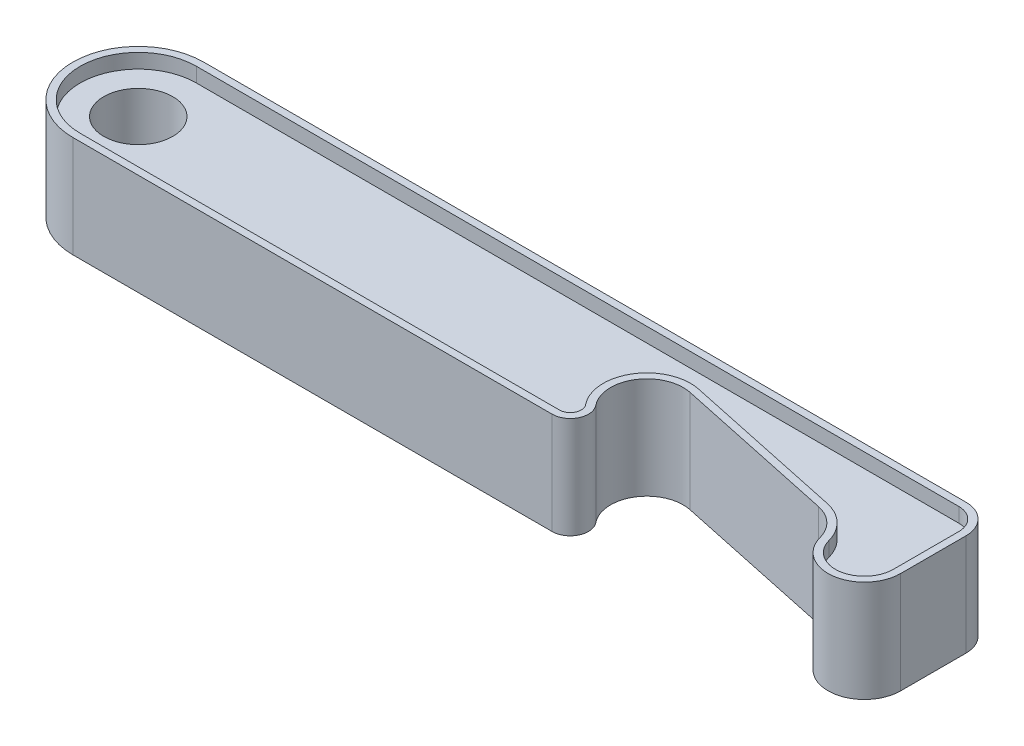
ISO-10303-21;
HEADER;
FILE_DESCRIPTION(('STEP AP214'),'2;1');
FILE_NAME('part.step','',(''),(''),'','','');
FILE_SCHEMA(('AUTOMOTIVE_DESIGN { 1 0 10303 214 1 1 1 1 }'));
ENDSEC;
DATA;
#1=APPLICATION_CONTEXT('core data for automotive mechanical design processes');
#2=APPLICATION_PROTOCOL_DEFINITION('international standard','automotive_design',2000,#1);
#3=PRODUCT_CONTEXT('',#1,'mechanical');
#4=PRODUCT('Part','Part','',(#3));
#5=PRODUCT_RELATED_PRODUCT_CATEGORY('part','',(#4));
#6=PRODUCT_DEFINITION_FORMATION('','',#4);
#7=PRODUCT_DEFINITION_CONTEXT('part definition',#1,'design');
#8=PRODUCT_DEFINITION('design','',#6,#7);
#9=PRODUCT_DEFINITION_SHAPE('','',#8);
#10=(LENGTH_UNIT() NAMED_UNIT(*) SI_UNIT(.MILLI.,.METRE.));
#11=(NAMED_UNIT(*) PLANE_ANGLE_UNIT() SI_UNIT($,.RADIAN.));
#12=(NAMED_UNIT(*) SI_UNIT($,.STERADIAN.) SOLID_ANGLE_UNIT());
#13=UNCERTAINTY_MEASURE_WITH_UNIT(LENGTH_MEASURE(1.E-05),#10,'distance_accuracy_value','');
#14=(GEOMETRIC_REPRESENTATION_CONTEXT(3) GLOBAL_UNCERTAINTY_ASSIGNED_CONTEXT((#13)) GLOBAL_UNIT_ASSIGNED_CONTEXT((#10,
#11,#12)) REPRESENTATION_CONTEXT('',''));
#15=CARTESIAN_POINT('',(0.,0.,0.));
#16=DIRECTION('',(0.,0.,1.));
#17=DIRECTION('',(1.,0.,0.));
#18=AXIS2_PLACEMENT_3D('',#15,#16,#17);
#19=CARTESIAN_POINT('',(0.,14.,0.));
#20=DIRECTION('',(0.,-1.,0.));
#21=DIRECTION('',(0.,0.,-1.));
#22=AXIS2_PLACEMENT_3D('',#19,#20,#21);
#23=CYLINDRICAL_SURFACE('',#22,4.75);
#24=CARTESIAN_POINT('',(0.,12.,0.));
#25=DIRECTION('',(0.,1.,0.));
#26=DIRECTION('',(0.,0.,1.));
#27=AXIS2_PLACEMENT_3D('',#24,#25,#26);
#28=CIRCLE('',#27,4.75);
#29=CARTESIAN_POINT('',(0.,12.,4.75));
#30=VERTEX_POINT('',#29);
#31=EDGE_CURVE('E383',#30,#30,#28,.T.);
#32=ORIENTED_EDGE('',*,*,#31,.T.);
#33=EDGE_LOOP('',(#32));
#34=FACE_BOUND('',#33,.T.);
#35=CARTESIAN_POINT('',(0.,2.,0.));
#36=DIRECTION('',(0.,-1.,0.));
#37=DIRECTION('',(0.,0.,-1.));
#38=AXIS2_PLACEMENT_3D('',#35,#36,#37);
#39=CIRCLE('',#38,4.75);
#40=CARTESIAN_POINT('',(0.,2.,-4.75));
#41=VERTEX_POINT('',#40);
#42=EDGE_CURVE('E41',#41,#41,#39,.T.);
#43=ORIENTED_EDGE('',*,*,#42,.T.);
#44=EDGE_LOOP('',(#43));
#45=FACE_BOUND('',#44,.T.);
#46=ADVANCED_FACE('F37',(#34,#45),#23,.F.);
#47=CARTESIAN_POINT('',(0.,14.,0.));
#48=DIRECTION('',(0.,-1.,0.));
#49=DIRECTION('',(0.,0.,-1.));
#50=AXIS2_PLACEMENT_3D('',#47,#48,#49);
#51=PLANE('',#50);
#52=DIRECTION('',(1.,0.,0.));
#53=VECTOR('',#52,1.);
#54=CARTESIAN_POINT('',(0.,14.,8.));
#55=LINE('',#54,#53);
#56=CARTESIAN_POINT('',(0.,14.,8.));
#57=VERTEX_POINT('',#56);
#58=CARTESIAN_POINT('',(66.,14.,7.99999999999998));
#59=VERTEX_POINT('',#58);
#60=EDGE_CURVE('E355',#57,#59,#55,.T.);
#61=ORIENTED_EDGE('',*,*,#60,.F.);
#62=CARTESIAN_POINT('',(0.,14.,0.));
#63=DIRECTION('',(0.,1.,0.));
#64=DIRECTION('',(0.,0.,1.));
#65=AXIS2_PLACEMENT_3D('',#62,#63,#64);
#66=CIRCLE('',#65,8.);
#67=CARTESIAN_POINT('',(0.,14.,-8.));
#68=VERTEX_POINT('',#67);
#69=EDGE_CURVE('E62',#68,#57,#66,.T.);
#70=ORIENTED_EDGE('',*,*,#69,.F.);
#71=DIRECTION('',(-1.,0.,0.));
#72=VECTOR('',#71,1.);
#73=CARTESIAN_POINT('',(105.,14.,-8.));
#74=LINE('',#73,#72);
#75=CARTESIAN_POINT('',(105.,14.,-8.));
#76=VERTEX_POINT('',#75);
#77=EDGE_CURVE('E326',#76,#68,#74,.T.);
#78=ORIENTED_EDGE('',*,*,#77,.F.);
#79=CARTESIAN_POINT('',(105.,14.,-5.));
#80=DIRECTION('',(0.,1.,0.));
#81=DIRECTION('',(0.,0.,1.));
#82=AXIS2_PLACEMENT_3D('',#79,#80,#81);
#83=CIRCLE('',#82,3.);
#84=CARTESIAN_POINT('',(108.,14.,-5.));
#85=VERTEX_POINT('',#84);
#86=EDGE_CURVE('E376',#85,#76,#83,.T.);
#87=ORIENTED_EDGE('',*,*,#86,.F.);
#88=DIRECTION('',(0.,0.,-1.));
#89=VECTOR('',#88,1.);
#90=CARTESIAN_POINT('',(108.,14.,4.));
#91=LINE('',#90,#89);
#92=CARTESIAN_POINT('',(108.,14.,4.));
#93=VERTEX_POINT('',#92);
#94=EDGE_CURVE('E373',#93,#85,#91,.T.);
#95=ORIENTED_EDGE('',*,*,#94,.F.);
#96=CARTESIAN_POINT('',(104.,14.,4.));
#97=DIRECTION('',(0.,1.,0.));
#98=DIRECTION('',(0.,0.,1.));
#99=AXIS2_PLACEMENT_3D('',#96,#97,#98);
#100=CIRCLE('',#99,4.);
#101=CARTESIAN_POINT('',(100.134614428619,14.,5.02897734890542));
#102=VERTEX_POINT('',#101);
#103=EDGE_CURVE('E370',#102,#93,#100,.T.);
#104=ORIENTED_EDGE('',*,*,#103,.F.);
#105=CARTESIAN_POINT('',(94.3365360715478,14.,6.57244337226353));
#106=DIRECTION('',(0.,-1.,0.));
#107=DIRECTION('',(0.,0.,1.));
#108=AXIS2_PLACEMENT_3D('',#105,#106,#107);
#109=CIRCLE('',#108,6.00000000000001);
#110=CARTESIAN_POINT('',(95.5840062164543,14.,0.703557767860689));
#111=VERTEX_POINT('',#110);
#112=EDGE_CURVE('E367',#111,#102,#109,.T.);
#113=ORIENTED_EDGE('',*,*,#112,.F.);
#114=DIRECTION('',(0.978147600733806,0.,0.207911690817759));
#115=VECTOR('',#114,1.);
#116=CARTESIAN_POINT('',(73.0840062164543,14.,-4.07896486971481));
#117=LINE('',#116,#115);
#118=CARTESIAN_POINT('',(73.0840062164543,14.,-4.07896486971481));
#119=VERTEX_POINT('',#118);
#120=EDGE_CURVE('E364',#119,#111,#117,.T.);
#121=ORIENTED_EDGE('',*,*,#120,.F.);
#122=CARTESIAN_POINT('',(71.8365360715477,14.,1.78992073468803));
#123=DIRECTION('',(0.,-1.,0.));
#124=DIRECTION('',(0.,0.,1.));
#125=AXIS2_PLACEMENT_3D('',#122,#123,#124);
#126=CIRCLE('',#125,6.);
#127=CARTESIAN_POINT('',(67.1673072143095,14.,5.55798414693761));
#128=VERTEX_POINT('',#127);
#129=EDGE_CURVE('E361',#128,#119,#126,.T.);
#130=ORIENTED_EDGE('',*,*,#129,.F.);
#131=CARTESIAN_POINT('',(66.,14.,6.5));
#132=DIRECTION('',(0.,1.,0.));
#133=DIRECTION('',(0.,0.,1.));
#134=AXIS2_PLACEMENT_3D('',#131,#132,#133);
#135=CIRCLE('',#134,1.49999999999999);
#136=EDGE_CURVE('E358',#59,#128,#135,.T.);
#137=ORIENTED_EDGE('',*,*,#136,.F.);
#138=EDGE_LOOP('',(#61,#70,#78,#87,#95,#104,#113,#121,#130,#137));
#139=FACE_BOUND('',#138,.T.);
#140=CARTESIAN_POINT('',(0.,14.,0.));
#141=DIRECTION('',(0.,1.,0.));
#142=DIRECTION('',(0.,0.,-1.));
#143=AXIS2_PLACEMENT_3D('',#140,#141,#142);
#144=CIRCLE('',#143,9.);
#145=CARTESIAN_POINT('',(0.,14.,-9.));
#146=VERTEX_POINT('',#145);
#147=CARTESIAN_POINT('',(0.,14.,9.00000000000001));
#148=VERTEX_POINT('',#147);
#149=EDGE_CURVE('E401',#146,#148,#144,.T.);
#150=ORIENTED_EDGE('',*,*,#149,.T.);
#151=DIRECTION('',(1.,0.,0.));
#152=VECTOR('',#151,1.);
#153=CARTESIAN_POINT('',(66.,14.,8.99999999999999));
#154=LINE('',#153,#152);
#155=CARTESIAN_POINT('',(66.,14.,8.99999999999999));
#156=VERTEX_POINT('',#155);
#157=EDGE_CURVE('E404',#148,#156,#154,.T.);
#158=ORIENTED_EDGE('',*,*,#157,.T.);
#159=CARTESIAN_POINT('',(66.,14.,6.5));
#160=DIRECTION('',(0.,1.,0.));
#161=DIRECTION('',(0.,0.,-1.));
#162=AXIS2_PLACEMENT_3D('',#159,#160,#161);
#163=CIRCLE('',#162,2.49999999999999);
#164=CARTESIAN_POINT('',(67.9455120238492,14.,4.92997357822934));
#165=VERTEX_POINT('',#164);
#166=EDGE_CURVE('E407',#156,#165,#163,.T.);
#167=ORIENTED_EDGE('',*,*,#166,.T.);
#168=CARTESIAN_POINT('',(71.8365360715477,14.,1.78992073468803));
#169=DIRECTION('',(0.,-1.,0.));
#170=DIRECTION('',(0.,0.,1.));
#171=AXIS2_PLACEMENT_3D('',#168,#169,#170);
#172=CIRCLE('',#171,5.);
#173=CARTESIAN_POINT('',(72.8760945256365,14.,-3.100817268981));
#174=VERTEX_POINT('',#173);
#175=EDGE_CURVE('E409',#165,#174,#172,.T.);
#176=ORIENTED_EDGE('',*,*,#175,.T.);
#177=DIRECTION('',(0.978147600733805,0.,0.20791169081776));
#178=VECTOR('',#177,1.);
#179=CARTESIAN_POINT('',(95.3760945256366,14.,1.6817053685945));
#180=LINE('',#179,#178);
#181=CARTESIAN_POINT('',(95.3760945256366,14.,1.68170536859449));
#182=VERTEX_POINT('',#181);
#183=EDGE_CURVE('E411',#174,#182,#180,.T.);
#184=ORIENTED_EDGE('',*,*,#183,.T.);
#185=CARTESIAN_POINT('',(94.3365360715478,14.,6.57244337226353));
#186=DIRECTION('',(0.,-1.,0.));
#187=DIRECTION('',(0.,0.,1.));
#188=AXIS2_PLACEMENT_3D('',#185,#186,#187);
#189=CIRCLE('',#188,5.00000000000001);
#190=CARTESIAN_POINT('',(99.1682680357739,14.,5.28622168613177));
#191=VERTEX_POINT('',#190);
#192=EDGE_CURVE('E413',#182,#191,#189,.T.);
#193=ORIENTED_EDGE('',*,*,#192,.T.);
#194=CARTESIAN_POINT('',(104.,14.,4.));
#195=DIRECTION('',(0.,1.,0.));
#196=DIRECTION('',(0.,0.,-1.));
#197=AXIS2_PLACEMENT_3D('',#194,#195,#196);
#198=CIRCLE('',#197,5.);
#199=CARTESIAN_POINT('',(109.,14.,4.));
#200=VERTEX_POINT('',#199);
#201=EDGE_CURVE('E415',#191,#200,#198,.T.);
#202=ORIENTED_EDGE('',*,*,#201,.T.);
#203=DIRECTION('',(0.,0.,-1.));
#204=VECTOR('',#203,1.);
#205=CARTESIAN_POINT('',(109.,14.,-5.));
#206=LINE('',#205,#204);
#207=CARTESIAN_POINT('',(109.,14.,-5.));
#208=VERTEX_POINT('',#207);
#209=EDGE_CURVE('E417',#200,#208,#206,.T.);
#210=ORIENTED_EDGE('',*,*,#209,.T.);
#211=CARTESIAN_POINT('',(105.,14.,-5.));
#212=DIRECTION('',(0.,1.,0.));
#213=DIRECTION('',(0.,0.,-1.));
#214=AXIS2_PLACEMENT_3D('',#211,#212,#213);
#215=CIRCLE('',#214,4.);
#216=CARTESIAN_POINT('',(105.,14.,-9.));
#217=VERTEX_POINT('',#216);
#218=EDGE_CURVE('E419',#208,#217,#215,.T.);
#219=ORIENTED_EDGE('',*,*,#218,.T.);
#220=DIRECTION('',(-1.,0.,0.));
#221=VECTOR('',#220,1.);
#222=CARTESIAN_POINT('',(0.,14.,-9.));
#223=LINE('',#222,#221);
#224=EDGE_CURVE('E421',#217,#146,#223,.T.);
#225=ORIENTED_EDGE('',*,*,#224,.T.);
#226=EDGE_LOOP('',(#150,#158,#167,#176,#184,#193,#202,#210,#219,#225));
#227=FACE_BOUND('',#226,.T.);
#228=ADVANCED_FACE('F516',(#139,#227),#51,.F.);
#229=CARTESIAN_POINT('',(0.,0.,0.));
#230=DIRECTION('',(0.,-1.,0.));
#231=DIRECTION('',(0.,0.,-1.));
#232=AXIS2_PLACEMENT_3D('',#229,#230,#231);
#233=PLANE('',#232);
#234=CARTESIAN_POINT('',(0.,0.,0.));
#235=DIRECTION('',(0.,-1.,0.));
#236=DIRECTION('',(0.,0.,-1.));
#237=AXIS2_PLACEMENT_3D('',#234,#235,#236);
#238=CIRCLE('',#237,8.);
#239=CARTESIAN_POINT('',(0.,0.,8.));
#240=VERTEX_POINT('',#239);
#241=CARTESIAN_POINT('',(0.,0.,-8.));
#242=VERTEX_POINT('',#241);
#243=EDGE_CURVE('E54',#240,#242,#238,.T.);
#244=ORIENTED_EDGE('',*,*,#243,.F.);
#245=DIRECTION('',(-1.,0.,0.));
#246=VECTOR('',#245,1.);
#247=CARTESIAN_POINT('',(66.,0.,7.99999999999998));
#248=LINE('',#247,#246);
#249=CARTESIAN_POINT('',(66.,0.,7.99999999999998));
#250=VERTEX_POINT('',#249);
#251=EDGE_CURVE('E257',#250,#240,#248,.T.);
#252=ORIENTED_EDGE('',*,*,#251,.F.);
#253=CARTESIAN_POINT('',(66.,0.,6.5));
#254=DIRECTION('',(0.,-1.,0.));
#255=DIRECTION('',(0.,0.,-1.));
#256=AXIS2_PLACEMENT_3D('',#253,#254,#255);
#257=CIRCLE('',#256,1.49999999999998);
#258=CARTESIAN_POINT('',(67.1673072143095,0.,5.55798414693761));
#259=VERTEX_POINT('',#258);
#260=EDGE_CURVE('E260',#259,#250,#257,.T.);
#261=ORIENTED_EDGE('',*,*,#260,.F.);
#262=CARTESIAN_POINT('',(71.8365360715477,0.,1.78992073468803));
#263=DIRECTION('',(0.,1.,0.));
#264=DIRECTION('',(0.,0.,-1.));
#265=AXIS2_PLACEMENT_3D('',#262,#263,#264);
#266=CIRCLE('',#265,6.);
#267=CARTESIAN_POINT('',(73.0840062164543,0.,-4.07896486971481));
#268=VERTEX_POINT('',#267);
#269=EDGE_CURVE('E300',#268,#259,#266,.T.);
#270=ORIENTED_EDGE('',*,*,#269,.F.);
#271=DIRECTION('',(-0.978147600733806,0.,-0.207911690817759));
#272=VECTOR('',#271,1.);
#273=CARTESIAN_POINT('',(95.5840062164543,0.,0.703557767860687));
#274=LINE('',#273,#272);
#275=CARTESIAN_POINT('',(95.5840062164543,0.,0.703557767860687));
#276=VERTEX_POINT('',#275);
#277=EDGE_CURVE('E297',#276,#268,#274,.T.);
#278=ORIENTED_EDGE('',*,*,#277,.F.);
#279=CARTESIAN_POINT('',(94.3365360715478,0.,6.57244337226353));
#280=DIRECTION('',(0.,1.,0.));
#281=DIRECTION('',(0.,0.,-1.));
#282=AXIS2_PLACEMENT_3D('',#279,#280,#281);
#283=CIRCLE('',#282,6.00000000000002);
#284=CARTESIAN_POINT('',(100.134614428619,0.,5.02897734890542));
#285=VERTEX_POINT('',#284);
#286=EDGE_CURVE('E294',#285,#276,#283,.T.);
#287=ORIENTED_EDGE('',*,*,#286,.F.);
#288=CARTESIAN_POINT('',(104.,0.,4.));
#289=DIRECTION('',(0.,-1.,0.));
#290=DIRECTION('',(0.,0.,-1.));
#291=AXIS2_PLACEMENT_3D('',#288,#289,#290);
#292=CIRCLE('',#291,4.);
#293=CARTESIAN_POINT('',(108.,0.,4.));
#294=VERTEX_POINT('',#293);
#295=EDGE_CURVE('E291',#294,#285,#292,.T.);
#296=ORIENTED_EDGE('',*,*,#295,.F.);
#297=DIRECTION('',(0.,0.,1.));
#298=VECTOR('',#297,1.);
#299=CARTESIAN_POINT('',(108.,0.,-5.));
#300=LINE('',#299,#298);
#301=CARTESIAN_POINT('',(108.,0.,-5.));
#302=VERTEX_POINT('',#301);
#303=EDGE_CURVE('E288',#302,#294,#300,.T.);
#304=ORIENTED_EDGE('',*,*,#303,.F.);
#305=CARTESIAN_POINT('',(105.,0.,-5.));
#306=DIRECTION('',(0.,-1.,0.));
#307=DIRECTION('',(0.,0.,-1.));
#308=AXIS2_PLACEMENT_3D('',#305,#306,#307);
#309=CIRCLE('',#308,3.);
#310=CARTESIAN_POINT('',(105.,0.,-8.));
#311=VERTEX_POINT('',#310);
#312=EDGE_CURVE('E285',#311,#302,#309,.T.);
#313=ORIENTED_EDGE('',*,*,#312,.F.);
#314=DIRECTION('',(1.,0.,0.));
#315=VECTOR('',#314,1.);
#316=CARTESIAN_POINT('',(0.,0.,-8.));
#317=LINE('',#316,#315);
#318=EDGE_CURVE('E283',#242,#311,#317,.T.);
#319=ORIENTED_EDGE('',*,*,#318,.F.);
#320=EDGE_LOOP('',(#244,#252,#261,#270,#278,#287,#296,#304,#313,#319));
#321=FACE_BOUND('',#320,.T.);
#322=CARTESIAN_POINT('',(0.,0.,0.));
#323=DIRECTION('',(0.,1.,0.));
#324=DIRECTION('',(0.,0.,-1.));
#325=AXIS2_PLACEMENT_3D('',#322,#323,#324);
#326=CIRCLE('',#325,9.);
#327=CARTESIAN_POINT('',(0.,0.,-9.));
#328=VERTEX_POINT('',#327);
#329=CARTESIAN_POINT('',(0.,0.,9.00000000000001));
#330=VERTEX_POINT('',#329);
#331=EDGE_CURVE('E424',#328,#330,#326,.T.);
#332=ORIENTED_EDGE('',*,*,#331,.F.);
#333=DIRECTION('',(-1.,0.,0.));
#334=VECTOR('',#333,1.);
#335=CARTESIAN_POINT('',(0.,0.,-9.));
#336=LINE('',#335,#334);
#337=CARTESIAN_POINT('',(105.,0.,-9.));
#338=VERTEX_POINT('',#337);
#339=EDGE_CURVE('E405',#338,#328,#336,.T.);
#340=ORIENTED_EDGE('',*,*,#339,.F.);
#341=CARTESIAN_POINT('',(105.,0.,-5.));
#342=DIRECTION('',(0.,1.,0.));
#343=DIRECTION('',(0.,0.,-1.));
#344=AXIS2_PLACEMENT_3D('',#341,#342,#343);
#345=CIRCLE('',#344,4.);
#346=CARTESIAN_POINT('',(109.,0.,-5.));
#347=VERTEX_POINT('',#346);
#348=EDGE_CURVE('E441',#347,#338,#345,.T.);
#349=ORIENTED_EDGE('',*,*,#348,.F.);
#350=DIRECTION('',(0.,0.,-1.));
#351=VECTOR('',#350,1.);
#352=CARTESIAN_POINT('',(109.,0.,-5.));
#353=LINE('',#352,#351);
#354=CARTESIAN_POINT('',(109.,0.,4.));
#355=VERTEX_POINT('',#354);
#356=EDGE_CURVE('E439',#355,#347,#353,.T.);
#357=ORIENTED_EDGE('',*,*,#356,.F.);
#358=CARTESIAN_POINT('',(104.,0.,4.));
#359=DIRECTION('',(0.,1.,0.));
#360=DIRECTION('',(0.,0.,-1.));
#361=AXIS2_PLACEMENT_3D('',#358,#359,#360);
#362=CIRCLE('',#361,5.);
#363=CARTESIAN_POINT('',(99.1682680357739,0.,5.28622168613177));
#364=VERTEX_POINT('',#363);
#365=EDGE_CURVE('E437',#364,#355,#362,.T.);
#366=ORIENTED_EDGE('',*,*,#365,.F.);
#367=CARTESIAN_POINT('',(94.3365360715478,0.,6.57244337226353));
#368=DIRECTION('',(0.,-1.,0.));
#369=DIRECTION('',(0.,0.,1.));
#370=AXIS2_PLACEMENT_3D('',#367,#368,#369);
#371=CIRCLE('',#370,5.00000000000001);
#372=CARTESIAN_POINT('',(95.3760945256366,0.,1.68170536859449));
#373=VERTEX_POINT('',#372);
#374=EDGE_CURVE('E435',#373,#364,#371,.T.);
#375=ORIENTED_EDGE('',*,*,#374,.F.);
#376=DIRECTION('',(0.978147600733805,0.,0.20791169081776));
#377=VECTOR('',#376,1.);
#378=CARTESIAN_POINT('',(95.3760945256366,0.,1.6817053685945));
#379=LINE('',#378,#377);
#380=CARTESIAN_POINT('',(72.8760945256365,0.,-3.100817268981));
#381=VERTEX_POINT('',#380);
#382=EDGE_CURVE('E433',#381,#373,#379,.T.);
#383=ORIENTED_EDGE('',*,*,#382,.F.);
#384=CARTESIAN_POINT('',(71.8365360715477,0.,1.78992073468803));
#385=DIRECTION('',(0.,-1.,0.));
#386=DIRECTION('',(0.,0.,1.));
#387=AXIS2_PLACEMENT_3D('',#384,#385,#386);
#388=CIRCLE('',#387,5.);
#389=CARTESIAN_POINT('',(67.9455120238492,0.,4.92997357822934));
#390=VERTEX_POINT('',#389);
#391=EDGE_CURVE('E431',#390,#381,#388,.T.);
#392=ORIENTED_EDGE('',*,*,#391,.F.);
#393=CARTESIAN_POINT('',(66.,0.,6.5));
#394=DIRECTION('',(0.,1.,0.));
#395=DIRECTION('',(0.,0.,-1.));
#396=AXIS2_PLACEMENT_3D('',#393,#394,#395);
#397=CIRCLE('',#396,2.49999999999999);
#398=CARTESIAN_POINT('',(66.,0.,8.99999999999999));
#399=VERTEX_POINT('',#398);
#400=EDGE_CURVE('E429',#399,#390,#397,.T.);
#401=ORIENTED_EDGE('',*,*,#400,.F.);
#402=DIRECTION('',(1.,0.,0.));
#403=VECTOR('',#402,1.);
#404=CARTESIAN_POINT('',(66.,0.,8.99999999999999));
#405=LINE('',#404,#403);
#406=EDGE_CURVE('E427',#330,#399,#405,.T.);
#407=ORIENTED_EDGE('',*,*,#406,.F.);
#408=EDGE_LOOP('',(#332,#340,#349,#357,#366,#375,#383,#392,#401,#407));
#409=FACE_BOUND('',#408,.T.);
#410=ADVANCED_FACE('F519',(#321,#409),#233,.T.);
#411=CARTESIAN_POINT('',(0.,14.,0.));
#412=DIRECTION('',(0.,-1.,0.));
#413=DIRECTION('',(0.,0.,-1.));
#414=AXIS2_PLACEMENT_3D('',#411,#412,#413);
#415=CYLINDRICAL_SURFACE('',#414,9.);
#416=ORIENTED_EDGE('',*,*,#331,.T.);
#417=DIRECTION('',(0.,-1.,0.));
#418=VECTOR('',#417,1.);
#419=CARTESIAN_POINT('',(0.,14.,9.00000000000001));
#420=LINE('',#419,#418);
#421=EDGE_CURVE('E11',#148,#330,#420,.T.);
#422=ORIENTED_EDGE('',*,*,#421,.F.);
#423=ORIENTED_EDGE('',*,*,#149,.F.);
#424=DIRECTION('',(0.,-1.,0.));
#425=VECTOR('',#424,1.);
#426=CARTESIAN_POINT('',(0.,14.,-9.));
#427=LINE('',#426,#425);
#428=EDGE_CURVE('E423',#146,#328,#427,.T.);
#429=ORIENTED_EDGE('',*,*,#428,.T.);
#430=EDGE_LOOP('',(#416,#422,#423,#429));
#431=FACE_BOUND('',#430,.T.);
#432=ADVANCED_FACE('F39',(#431),#415,.T.);
#433=CARTESIAN_POINT('',(66.,14.,8.99999999999999));
#434=DIRECTION('',(0.,0.,-1.));
#435=DIRECTION('',(-1.,0.,0.));
#436=AXIS2_PLACEMENT_3D('',#433,#434,#435);
#437=PLANE('',#436);
#438=ORIENTED_EDGE('',*,*,#406,.T.);
#439=DIRECTION('',(0.,-1.,0.));
#440=VECTOR('',#439,1.);
#441=CARTESIAN_POINT('',(66.,14.,8.99999999999999));
#442=LINE('',#441,#440);
#443=EDGE_CURVE('E46',#156,#399,#442,.T.);
#444=ORIENTED_EDGE('',*,*,#443,.F.);
#445=ORIENTED_EDGE('',*,*,#157,.F.);
#446=ORIENTED_EDGE('',*,*,#421,.T.);
#447=EDGE_LOOP('',(#438,#444,#445,#446));
#448=FACE_BOUND('',#447,.T.);
#449=ADVANCED_FACE('F529',(#448),#437,.F.);
#450=CARTESIAN_POINT('',(66.,14.,6.5));
#451=DIRECTION('',(0.,-1.,0.));
#452=DIRECTION('',(0.,0.,-1.));
#453=AXIS2_PLACEMENT_3D('',#450,#451,#452);
#454=CYLINDRICAL_SURFACE('',#453,2.49999999999999);
#455=ORIENTED_EDGE('',*,*,#400,.T.);
#456=DIRECTION('',(0.,-1.,0.));
#457=VECTOR('',#456,1.);
#458=CARTESIAN_POINT('',(67.9455120238492,14.,4.92997357822934));
#459=LINE('',#458,#457);
#460=EDGE_CURVE('E464',#165,#390,#459,.T.);
#461=ORIENTED_EDGE('',*,*,#460,.F.);
#462=ORIENTED_EDGE('',*,*,#166,.F.);
#463=ORIENTED_EDGE('',*,*,#443,.T.);
#464=EDGE_LOOP('',(#455,#461,#462,#463));
#465=FACE_BOUND('',#464,.T.);
#466=ADVANCED_FACE('F534',(#465),#454,.T.);
#467=CARTESIAN_POINT('',(71.8365360715477,14.,1.78992073468803));
#468=DIRECTION('',(0.,-1.,0.));
#469=DIRECTION('',(0.,0.,-1.));
#470=AXIS2_PLACEMENT_3D('',#467,#468,#469);
#471=CYLINDRICAL_SURFACE('',#470,5.);
#472=ORIENTED_EDGE('',*,*,#391,.T.);
#473=DIRECTION('',(0.,-1.,0.));
#474=VECTOR('',#473,1.);
#475=CARTESIAN_POINT('',(72.8760945256365,14.,-3.100817268981));
#476=LINE('',#475,#474);
#477=EDGE_CURVE('E461',#174,#381,#476,.T.);
#478=ORIENTED_EDGE('',*,*,#477,.F.);
#479=ORIENTED_EDGE('',*,*,#175,.F.);
#480=ORIENTED_EDGE('',*,*,#460,.T.);
#481=EDGE_LOOP('',(#472,#478,#479,#480));
#482=FACE_BOUND('',#481,.T.);
#483=ADVANCED_FACE('F540',(#482),#471,.F.);
#484=CARTESIAN_POINT('',(95.3760945256366,14.,1.6817053685945));
#485=DIRECTION('',(0.20791169081776,0.,-0.978147600733805));
#486=DIRECTION('',(-0.978147600733806,0.,-0.20791169081776));
#487=AXIS2_PLACEMENT_3D('',#484,#485,#486);
#488=PLANE('',#487);
#489=ORIENTED_EDGE('',*,*,#382,.T.);
#490=DIRECTION('',(0.,-1.,0.));
#491=VECTOR('',#490,1.);
#492=CARTESIAN_POINT('',(95.3760945256366,14.,1.68170536859449));
#493=LINE('',#492,#491);
#494=EDGE_CURVE('E458',#182,#373,#493,.T.);
#495=ORIENTED_EDGE('',*,*,#494,.F.);
#496=ORIENTED_EDGE('',*,*,#183,.F.);
#497=ORIENTED_EDGE('',*,*,#477,.T.);
#498=EDGE_LOOP('',(#489,#495,#496,#497));
#499=FACE_BOUND('',#498,.T.);
#500=ADVANCED_FACE('F544',(#499),#488,.F.);
#501=CARTESIAN_POINT('',(94.3365360715478,14.,6.57244337226353));
#502=DIRECTION('',(0.,-1.,0.));
#503=DIRECTION('',(0.,0.,-1.));
#504=AXIS2_PLACEMENT_3D('',#501,#502,#503);
#505=CYLINDRICAL_SURFACE('',#504,5.00000000000001);
#506=ORIENTED_EDGE('',*,*,#374,.T.);
#507=DIRECTION('',(0.,-1.,0.));
#508=VECTOR('',#507,1.);
#509=CARTESIAN_POINT('',(99.1682680357739,14.,5.28622168613177));
#510=LINE('',#509,#508);
#511=EDGE_CURVE('E455',#191,#364,#510,.T.);
#512=ORIENTED_EDGE('',*,*,#511,.F.);
#513=ORIENTED_EDGE('',*,*,#192,.F.);
#514=ORIENTED_EDGE('',*,*,#494,.T.);
#515=EDGE_LOOP('',(#506,#512,#513,#514));
#516=FACE_BOUND('',#515,.T.);
#517=ADVANCED_FACE('F549',(#516),#505,.F.);
#518=CARTESIAN_POINT('',(104.,14.,4.));
#519=DIRECTION('',(0.,-1.,0.));
#520=DIRECTION('',(0.,0.,-1.));
#521=AXIS2_PLACEMENT_3D('',#518,#519,#520);
#522=CYLINDRICAL_SURFACE('',#521,5.);
#523=ORIENTED_EDGE('',*,*,#365,.T.);
#524=DIRECTION('',(0.,-1.,0.));
#525=VECTOR('',#524,1.);
#526=CARTESIAN_POINT('',(109.,14.,4.));
#527=LINE('',#526,#525);
#528=EDGE_CURVE('E452',#200,#355,#527,.T.);
#529=ORIENTED_EDGE('',*,*,#528,.F.);
#530=ORIENTED_EDGE('',*,*,#201,.F.);
#531=ORIENTED_EDGE('',*,*,#511,.T.);
#532=EDGE_LOOP('',(#523,#529,#530,#531));
#533=FACE_BOUND('',#532,.T.);
#534=ADVANCED_FACE('F555',(#533),#522,.T.);
#535=CARTESIAN_POINT('',(109.,14.,-5.));
#536=DIRECTION('',(-1.,0.,0.));
#537=DIRECTION('',(0.,0.,1.));
#538=AXIS2_PLACEMENT_3D('',#535,#536,#537);
#539=PLANE('',#538);
#540=ORIENTED_EDGE('',*,*,#356,.T.);
#541=DIRECTION('',(0.,-1.,0.));
#542=VECTOR('',#541,1.);
#543=CARTESIAN_POINT('',(109.,14.,-5.));
#544=LINE('',#543,#542);
#545=EDGE_CURVE('E449',#208,#347,#544,.T.);
#546=ORIENTED_EDGE('',*,*,#545,.F.);
#547=ORIENTED_EDGE('',*,*,#209,.F.);
#548=ORIENTED_EDGE('',*,*,#528,.T.);
#549=EDGE_LOOP('',(#540,#546,#547,#548));
#550=FACE_BOUND('',#549,.T.);
#551=ADVANCED_FACE('F559',(#550),#539,.F.);
#552=CARTESIAN_POINT('',(105.,14.,-5.));
#553=DIRECTION('',(0.,-1.,0.));
#554=DIRECTION('',(0.,0.,-1.));
#555=AXIS2_PLACEMENT_3D('',#552,#553,#554);
#556=CYLINDRICAL_SURFACE('',#555,4.);
#557=ORIENTED_EDGE('',*,*,#348,.T.);
#558=DIRECTION('',(0.,-1.,0.));
#559=VECTOR('',#558,1.);
#560=CARTESIAN_POINT('',(105.,14.,-9.));
#561=LINE('',#560,#559);
#562=EDGE_CURVE('E446',#217,#338,#561,.T.);
#563=ORIENTED_EDGE('',*,*,#562,.F.);
#564=ORIENTED_EDGE('',*,*,#218,.F.);
#565=ORIENTED_EDGE('',*,*,#545,.T.);
#566=EDGE_LOOP('',(#557,#563,#564,#565));
#567=FACE_BOUND('',#566,.T.);
#568=ADVANCED_FACE('F564',(#567),#556,.T.);
#569=CARTESIAN_POINT('',(0.,14.,-9.));
#570=DIRECTION('',(0.,0.,1.));
#571=DIRECTION('',(1.,0.,0.));
#572=AXIS2_PLACEMENT_3D('',#569,#570,#571);
#573=PLANE('',#572);
#574=ORIENTED_EDGE('',*,*,#339,.T.);
#575=ORIENTED_EDGE('',*,*,#428,.F.);
#576=ORIENTED_EDGE('',*,*,#224,.F.);
#577=ORIENTED_EDGE('',*,*,#562,.T.);
#578=EDGE_LOOP('',(#574,#575,#576,#577));
#579=FACE_BOUND('',#578,.T.);
#580=ADVANCED_FACE('F567',(#579),#573,.F.);
#581=CARTESIAN_POINT('',(0.,12.,0.));
#582=DIRECTION('',(0.,1.,0.));
#583=DIRECTION('',(0.,0.,1.));
#584=AXIS2_PLACEMENT_3D('',#581,#582,#583);
#585=CYLINDRICAL_SURFACE('',#584,8.);
#586=ORIENTED_EDGE('',*,*,#69,.T.);
#587=DIRECTION('',(0.,1.,0.));
#588=VECTOR('',#587,1.);
#589=CARTESIAN_POINT('',(0.,12.,8.));
#590=LINE('',#589,#588);
#591=CARTESIAN_POINT('',(0.,12.,8.));
#592=VERTEX_POINT('',#591);
#593=EDGE_CURVE('E353',#592,#57,#590,.T.);
#594=ORIENTED_EDGE('',*,*,#593,.F.);
#595=CARTESIAN_POINT('',(0.,12.,0.));
#596=DIRECTION('',(0.,1.,0.));
#597=DIRECTION('',(0.,0.,1.));
#598=AXIS2_PLACEMENT_3D('',#595,#596,#597);
#599=CIRCLE('',#598,8.);
#600=CARTESIAN_POINT('',(0.,12.,-8.));
#601=VERTEX_POINT('',#600);
#602=EDGE_CURVE('E322',#601,#592,#599,.T.);
#603=ORIENTED_EDGE('',*,*,#602,.F.);
#604=DIRECTION('',(0.,1.,0.));
#605=VECTOR('',#604,1.);
#606=CARTESIAN_POINT('',(0.,12.,-8.));
#607=LINE('',#606,#605);
#608=EDGE_CURVE('E381',#601,#68,#607,.T.);
#609=ORIENTED_EDGE('',*,*,#608,.T.);
#610=EDGE_LOOP('',(#586,#594,#603,#609));
#611=FACE_BOUND('',#610,.T.);
#612=ADVANCED_FACE('F481',(#611),#585,.F.);
#613=CARTESIAN_POINT('',(105.,12.,-8.));
#614=DIRECTION('',(0.,0.,-1.));
#615=DIRECTION('',(-1.,0.,0.));
#616=AXIS2_PLACEMENT_3D('',#613,#614,#615);
#617=PLANE('',#616);
#618=ORIENTED_EDGE('',*,*,#77,.T.);
#619=ORIENTED_EDGE('',*,*,#608,.F.);
#620=DIRECTION('',(-1.,0.,0.));
#621=VECTOR('',#620,1.);
#622=CARTESIAN_POINT('',(105.,12.,-8.));
#623=LINE('',#622,#621);
#624=CARTESIAN_POINT('',(105.,12.,-8.));
#625=VERTEX_POINT('',#624);
#626=EDGE_CURVE('E350',#625,#601,#623,.T.);
#627=ORIENTED_EDGE('',*,*,#626,.F.);
#628=DIRECTION('',(0.,1.,0.));
#629=VECTOR('',#628,1.);
#630=CARTESIAN_POINT('',(105.,12.,-8.));
#631=LINE('',#630,#629);
#632=EDGE_CURVE('E384',#625,#76,#631,.T.);
#633=ORIENTED_EDGE('',*,*,#632,.T.);
#634=EDGE_LOOP('',(#618,#619,#627,#633));
#635=FACE_BOUND('',#634,.T.);
#636=ADVANCED_FACE('F513',(#635),#617,.F.);
#637=CARTESIAN_POINT('',(105.,12.,-5.));
#638=DIRECTION('',(0.,1.,0.));
#639=DIRECTION('',(0.,0.,1.));
#640=AXIS2_PLACEMENT_3D('',#637,#638,#639);
#641=CYLINDRICAL_SURFACE('',#640,3.);
#642=ORIENTED_EDGE('',*,*,#86,.T.);
#643=ORIENTED_EDGE('',*,*,#632,.F.);
#644=CARTESIAN_POINT('',(105.,12.,-5.));
#645=DIRECTION('',(0.,1.,0.));
#646=DIRECTION('',(0.,0.,1.));
#647=AXIS2_PLACEMENT_3D('',#644,#645,#646);
#648=CIRCLE('',#647,3.);
#649=CARTESIAN_POINT('',(108.,12.,-5.));
#650=VERTEX_POINT('',#649);
#651=EDGE_CURVE('E347',#650,#625,#648,.T.);
#652=ORIENTED_EDGE('',*,*,#651,.F.);
#653=DIRECTION('',(0.,1.,0.));
#654=VECTOR('',#653,1.);
#655=CARTESIAN_POINT('',(108.,12.,-5.));
#656=LINE('',#655,#654);
#657=EDGE_CURVE('E386',#650,#85,#656,.T.);
#658=ORIENTED_EDGE('',*,*,#657,.T.);
#659=EDGE_LOOP('',(#642,#643,#652,#658));
#660=FACE_BOUND('',#659,.T.);
#661=ADVANCED_FACE('F511',(#660),#641,.F.);
#662=CARTESIAN_POINT('',(108.,12.,4.));
#663=DIRECTION('',(1.,0.,0.));
#664=DIRECTION('',(0.,0.,-1.));
#665=AXIS2_PLACEMENT_3D('',#662,#663,#664);
#666=PLANE('',#665);
#667=ORIENTED_EDGE('',*,*,#94,.T.);
#668=ORIENTED_EDGE('',*,*,#657,.F.);
#669=DIRECTION('',(0.,0.,-1.));
#670=VECTOR('',#669,1.);
#671=CARTESIAN_POINT('',(108.,12.,4.));
#672=LINE('',#671,#670);
#673=CARTESIAN_POINT('',(108.,12.,4.));
#674=VERTEX_POINT('',#673);
#675=EDGE_CURVE('E344',#674,#650,#672,.T.);
#676=ORIENTED_EDGE('',*,*,#675,.F.);
#677=DIRECTION('',(0.,1.,0.));
#678=VECTOR('',#677,1.);
#679=CARTESIAN_POINT('',(108.,12.,4.));
#680=LINE('',#679,#678);
#681=EDGE_CURVE('E388',#674,#93,#680,.T.);
#682=ORIENTED_EDGE('',*,*,#681,.T.);
#683=EDGE_LOOP('',(#667,#668,#676,#682));
#684=FACE_BOUND('',#683,.T.);
#685=ADVANCED_FACE('F507',(#684),#666,.F.);
#686=CARTESIAN_POINT('',(104.,12.,4.));
#687=DIRECTION('',(0.,1.,0.));
#688=DIRECTION('',(0.,0.,1.));
#689=AXIS2_PLACEMENT_3D('',#686,#687,#688);
#690=CYLINDRICAL_SURFACE('',#689,4.);
#691=ORIENTED_EDGE('',*,*,#103,.T.);
#692=ORIENTED_EDGE('',*,*,#681,.F.);
#693=CARTESIAN_POINT('',(104.,12.,4.));
#694=DIRECTION('',(0.,1.,0.));
#695=DIRECTION('',(0.,0.,1.));
#696=AXIS2_PLACEMENT_3D('',#693,#694,#695);
#697=CIRCLE('',#696,4.);
#698=CARTESIAN_POINT('',(100.134614428619,12.,5.02897734890542));
#699=VERTEX_POINT('',#698);
#700=EDGE_CURVE('E341',#699,#674,#697,.T.);
#701=ORIENTED_EDGE('',*,*,#700,.F.);
#702=DIRECTION('',(0.,1.,0.));
#703=VECTOR('',#702,1.);
#704=CARTESIAN_POINT('',(100.134614428619,12.,5.02897734890542));
#705=LINE('',#704,#703);
#706=EDGE_CURVE('E390',#699,#102,#705,.T.);
#707=ORIENTED_EDGE('',*,*,#706,.T.);
#708=EDGE_LOOP('',(#691,#692,#701,#707));
#709=FACE_BOUND('',#708,.T.);
#710=ADVANCED_FACE('F503',(#709),#690,.F.);
#711=CARTESIAN_POINT('',(94.3365360715478,12.,6.57244337226353));
#712=DIRECTION('',(0.,1.,0.));
#713=DIRECTION('',(0.,0.,1.));
#714=AXIS2_PLACEMENT_3D('',#711,#712,#713);
#715=CYLINDRICAL_SURFACE('',#714,6.00000000000001);
#716=ORIENTED_EDGE('',*,*,#112,.T.);
#717=ORIENTED_EDGE('',*,*,#706,.F.);
#718=CARTESIAN_POINT('',(94.3365360715478,12.,6.57244337226353));
#719=DIRECTION('',(0.,-1.,0.));
#720=DIRECTION('',(0.,0.,1.));
#721=AXIS2_PLACEMENT_3D('',#718,#719,#720);
#722=CIRCLE('',#721,6.00000000000001);
#723=CARTESIAN_POINT('',(95.5840062164543,12.,0.703557767860689));
#724=VERTEX_POINT('',#723);
#725=EDGE_CURVE('E338',#724,#699,#722,.T.);
#726=ORIENTED_EDGE('',*,*,#725,.F.);
#727=DIRECTION('',(0.,1.,0.));
#728=VECTOR('',#727,1.);
#729=CARTESIAN_POINT('',(95.5840062164543,12.,0.703557767860689));
#730=LINE('',#729,#728);
#731=EDGE_CURVE('E392',#724,#111,#730,.T.);
#732=ORIENTED_EDGE('',*,*,#731,.T.);
#733=EDGE_LOOP('',(#716,#717,#726,#732));
#734=FACE_BOUND('',#733,.T.);
#735=ADVANCED_FACE('F499',(#734),#715,.T.);
#736=CARTESIAN_POINT('',(73.0840062164543,12.,-4.07896486971481));
#737=DIRECTION('',(-0.207911690817759,0.,0.978147600733806));
#738=DIRECTION('',(0.978147600733806,0.,0.207911690817759));
#739=AXIS2_PLACEMENT_3D('',#736,#737,#738);
#740=PLANE('',#739);
#741=ORIENTED_EDGE('',*,*,#120,.T.);
#742=ORIENTED_EDGE('',*,*,#731,.F.);
#743=DIRECTION('',(0.978147600733806,0.,0.207911690817759));
#744=VECTOR('',#743,1.);
#745=CARTESIAN_POINT('',(73.0840062164543,12.,-4.07896486971481));
#746=LINE('',#745,#744);
#747=CARTESIAN_POINT('',(73.0840062164543,12.,-4.07896486971481));
#748=VERTEX_POINT('',#747);
#749=EDGE_CURVE('E335',#748,#724,#746,.T.);
#750=ORIENTED_EDGE('',*,*,#749,.F.);
#751=DIRECTION('',(0.,1.,0.));
#752=VECTOR('',#751,1.);
#753=CARTESIAN_POINT('',(73.0840062164543,12.,-4.07896486971481));
#754=LINE('',#753,#752);
#755=EDGE_CURVE('E394',#748,#119,#754,.T.);
#756=ORIENTED_EDGE('',*,*,#755,.T.);
#757=EDGE_LOOP('',(#741,#742,#750,#756));
#758=FACE_BOUND('',#757,.T.);
#759=ADVANCED_FACE('F495',(#758),#740,.F.);
#760=CARTESIAN_POINT('',(71.8365360715477,12.,1.78992073468803));
#761=DIRECTION('',(0.,1.,0.));
#762=DIRECTION('',(0.,0.,1.));
#763=AXIS2_PLACEMENT_3D('',#760,#761,#762);
#764=CYLINDRICAL_SURFACE('',#763,6.);
#765=ORIENTED_EDGE('',*,*,#129,.T.);
#766=ORIENTED_EDGE('',*,*,#755,.F.);
#767=CARTESIAN_POINT('',(71.8365360715477,12.,1.78992073468803));
#768=DIRECTION('',(0.,-1.,0.));
#769=DIRECTION('',(0.,0.,1.));
#770=AXIS2_PLACEMENT_3D('',#767,#768,#769);
#771=CIRCLE('',#770,6.);
#772=CARTESIAN_POINT('',(67.1673072143095,12.,5.55798414693761));
#773=VERTEX_POINT('',#772);
#774=EDGE_CURVE('E332',#773,#748,#771,.T.);
#775=ORIENTED_EDGE('',*,*,#774,.F.);
#776=DIRECTION('',(0.,1.,0.));
#777=VECTOR('',#776,1.);
#778=CARTESIAN_POINT('',(67.1673072143095,12.,5.55798414693761));
#779=LINE('',#778,#777);
#780=EDGE_CURVE('E396',#773,#128,#779,.T.);
#781=ORIENTED_EDGE('',*,*,#780,.T.);
#782=EDGE_LOOP('',(#765,#766,#775,#781));
#783=FACE_BOUND('',#782,.T.);
#784=ADVANCED_FACE('F491',(#783),#764,.T.);
#785=CARTESIAN_POINT('',(66.,12.,6.5));
#786=DIRECTION('',(0.,1.,0.));
#787=DIRECTION('',(0.,0.,1.));
#788=AXIS2_PLACEMENT_3D('',#785,#786,#787);
#789=CYLINDRICAL_SURFACE('',#788,1.49999999999999);
#790=ORIENTED_EDGE('',*,*,#136,.T.);
#791=ORIENTED_EDGE('',*,*,#780,.F.);
#792=CARTESIAN_POINT('',(66.,12.,6.5));
#793=DIRECTION('',(0.,1.,0.));
#794=DIRECTION('',(0.,0.,1.));
#795=AXIS2_PLACEMENT_3D('',#792,#793,#794);
#796=CIRCLE('',#795,1.49999999999999);
#797=CARTESIAN_POINT('',(66.,12.,7.99999999999998));
#798=VERTEX_POINT('',#797);
#799=EDGE_CURVE('E329',#798,#773,#796,.T.);
#800=ORIENTED_EDGE('',*,*,#799,.F.);
#801=DIRECTION('',(0.,1.,0.));
#802=VECTOR('',#801,1.);
#803=CARTESIAN_POINT('',(66.,12.,7.99999999999998));
#804=LINE('',#803,#802);
#805=EDGE_CURVE('E398',#798,#59,#804,.T.);
#806=ORIENTED_EDGE('',*,*,#805,.T.);
#807=EDGE_LOOP('',(#790,#791,#800,#806));
#808=FACE_BOUND('',#807,.T.);
#809=ADVANCED_FACE('F487',(#808),#789,.F.);
#810=CARTESIAN_POINT('',(0.,12.,8.));
#811=DIRECTION('',(0.,0.,1.));
#812=DIRECTION('',(1.,0.,0.));
#813=AXIS2_PLACEMENT_3D('',#810,#811,#812);
#814=PLANE('',#813);
#815=ORIENTED_EDGE('',*,*,#60,.T.);
#816=ORIENTED_EDGE('',*,*,#805,.F.);
#817=DIRECTION('',(1.,0.,0.));
#818=VECTOR('',#817,1.);
#819=CARTESIAN_POINT('',(0.,12.,8.));
#820=LINE('',#819,#818);
#821=EDGE_CURVE('E325',#592,#798,#820,.T.);
#822=ORIENTED_EDGE('',*,*,#821,.F.);
#823=ORIENTED_EDGE('',*,*,#593,.T.);
#824=EDGE_LOOP('',(#815,#816,#822,#823));
#825=FACE_BOUND('',#824,.T.);
#826=ADVANCED_FACE('F476',(#825),#814,.F.);
#827=CARTESIAN_POINT('',(0.,12.,0.));
#828=DIRECTION('',(0.,1.,0.));
#829=DIRECTION('',(0.,0.,1.));
#830=AXIS2_PLACEMENT_3D('',#827,#828,#829);
#831=PLANE('',#830);
#832=ORIENTED_EDGE('',*,*,#31,.F.);
#833=EDGE_LOOP('',(#832));
#834=FACE_BOUND('',#833,.T.);
#835=ORIENTED_EDGE('',*,*,#602,.T.);
#836=ORIENTED_EDGE('',*,*,#821,.T.);
#837=ORIENTED_EDGE('',*,*,#799,.T.);
#838=ORIENTED_EDGE('',*,*,#774,.T.);
#839=ORIENTED_EDGE('',*,*,#749,.T.);
#840=ORIENTED_EDGE('',*,*,#725,.T.);
#841=ORIENTED_EDGE('',*,*,#700,.T.);
#842=ORIENTED_EDGE('',*,*,#675,.T.);
#843=ORIENTED_EDGE('',*,*,#651,.T.);
#844=ORIENTED_EDGE('',*,*,#626,.T.);
#845=EDGE_LOOP('',(#835,#836,#837,#838,#839,#840,#841,#842,#843,#844));
#846=FACE_BOUND('',#845,.T.);
#847=ADVANCED_FACE('F473',(#834,#846),#831,.T.);
#848=CARTESIAN_POINT('',(0.,2.,0.));
#849=DIRECTION('',(0.,-1.,0.));
#850=DIRECTION('',(0.,0.,-1.));
#851=AXIS2_PLACEMENT_3D('',#848,#849,#850);
#852=CYLINDRICAL_SURFACE('',#851,8.);
#853=ORIENTED_EDGE('',*,*,#243,.T.);
#854=DIRECTION('',(0.,-1.,0.));
#855=VECTOR('',#854,1.);
#856=CARTESIAN_POINT('',(0.,2.,-8.));
#857=LINE('',#856,#855);
#858=CARTESIAN_POINT('',(0.,2.,-8.));
#859=VERTEX_POINT('',#858);
#860=EDGE_CURVE('E234',#859,#242,#857,.T.);
#861=ORIENTED_EDGE('',*,*,#860,.F.);
#862=CARTESIAN_POINT('',(0.,2.,0.));
#863=DIRECTION('',(0.,-1.,0.));
#864=DIRECTION('',(0.,0.,-1.));
#865=AXIS2_PLACEMENT_3D('',#862,#863,#864);
#866=CIRCLE('',#865,8.);
#867=CARTESIAN_POINT('',(0.,2.,8.));
#868=VERTEX_POINT('',#867);
#869=EDGE_CURVE('E238',#868,#859,#866,.T.);
#870=ORIENTED_EDGE('',*,*,#869,.F.);
#871=DIRECTION('',(0.,-1.,0.));
#872=VECTOR('',#871,1.);
#873=CARTESIAN_POINT('',(0.,2.,8.));
#874=LINE('',#873,#872);
#875=EDGE_CURVE('E305',#868,#240,#874,.T.);
#876=ORIENTED_EDGE('',*,*,#875,.T.);
#877=EDGE_LOOP('',(#853,#861,#870,#876));
#878=FACE_BOUND('',#877,.T.);
#879=ADVANCED_FACE('F236',(#878),#852,.F.);
#880=CARTESIAN_POINT('',(66.,2.,7.99999999999998));
#881=DIRECTION('',(0.,0.,1.));
#882=DIRECTION('',(1.,0.,0.));
#883=AXIS2_PLACEMENT_3D('',#880,#881,#882);
#884=PLANE('',#883);
#885=ORIENTED_EDGE('',*,*,#251,.T.);
#886=ORIENTED_EDGE('',*,*,#875,.F.);
#887=DIRECTION('',(-1.,0.,0.));
#888=VECTOR('',#887,1.);
#889=CARTESIAN_POINT('',(66.,2.,7.99999999999998));
#890=LINE('',#889,#888);
#891=CARTESIAN_POINT('',(66.,2.,7.99999999999998));
#892=VERTEX_POINT('',#891);
#893=EDGE_CURVE('E244',#892,#868,#890,.T.);
#894=ORIENTED_EDGE('',*,*,#893,.F.);
#895=DIRECTION('',(0.,-1.,0.));
#896=VECTOR('',#895,1.);
#897=CARTESIAN_POINT('',(66.,2.,7.99999999999998));
#898=LINE('',#897,#896);
#899=EDGE_CURVE('E307',#892,#250,#898,.T.);
#900=ORIENTED_EDGE('',*,*,#899,.T.);
#901=EDGE_LOOP('',(#885,#886,#894,#900));
#902=FACE_BOUND('',#901,.T.);
#903=ADVANCED_FACE('F603',(#902),#884,.F.);
#904=CARTESIAN_POINT('',(66.,2.,6.5));
#905=DIRECTION('',(0.,-1.,0.));
#906=DIRECTION('',(0.,0.,-1.));
#907=AXIS2_PLACEMENT_3D('',#904,#905,#906);
#908=CYLINDRICAL_SURFACE('',#907,1.49999999999998);
#909=ORIENTED_EDGE('',*,*,#260,.T.);
#910=ORIENTED_EDGE('',*,*,#899,.F.);
#911=CARTESIAN_POINT('',(66.,2.,6.5));
#912=DIRECTION('',(0.,-1.,0.));
#913=DIRECTION('',(0.,0.,-1.));
#914=AXIS2_PLACEMENT_3D('',#911,#912,#913);
#915=CIRCLE('',#914,1.49999999999998);
#916=CARTESIAN_POINT('',(67.1673072143095,2.,5.55798414693761));
#917=VERTEX_POINT('',#916);
#918=EDGE_CURVE('E279',#917,#892,#915,.T.);
#919=ORIENTED_EDGE('',*,*,#918,.F.);
#920=DIRECTION('',(0.,-1.,0.));
#921=VECTOR('',#920,1.);
#922=CARTESIAN_POINT('',(67.1673072143095,2.,5.55798414693761));
#923=LINE('',#922,#921);
#924=EDGE_CURVE('E309',#917,#259,#923,.T.);
#925=ORIENTED_EDGE('',*,*,#924,.T.);
#926=EDGE_LOOP('',(#909,#910,#919,#925));
#927=FACE_BOUND('',#926,.T.);
#928=ADVANCED_FACE('F629',(#927),#908,.F.);
#929=CARTESIAN_POINT('',(71.8365360715477,2.,1.78992073468803));
#930=DIRECTION('',(0.,-1.,0.));
#931=DIRECTION('',(0.,0.,-1.));
#932=AXIS2_PLACEMENT_3D('',#929,#930,#931);
#933=CYLINDRICAL_SURFACE('',#932,6.);
#934=ORIENTED_EDGE('',*,*,#269,.T.);
#935=ORIENTED_EDGE('',*,*,#924,.F.);
#936=CARTESIAN_POINT('',(71.8365360715477,2.,1.78992073468803));
#937=DIRECTION('',(0.,1.,0.));
#938=DIRECTION('',(0.,0.,-1.));
#939=AXIS2_PLACEMENT_3D('',#936,#937,#938);
#940=CIRCLE('',#939,6.);
#941=CARTESIAN_POINT('',(73.0840062164543,2.,-4.07896486971481));
#942=VERTEX_POINT('',#941);
#943=EDGE_CURVE('E276',#942,#917,#940,.T.);
#944=ORIENTED_EDGE('',*,*,#943,.F.);
#945=DIRECTION('',(0.,-1.,0.));
#946=VECTOR('',#945,1.);
#947=CARTESIAN_POINT('',(73.0840062164543,2.,-4.07896486971481));
#948=LINE('',#947,#946);
#949=EDGE_CURVE('E311',#942,#268,#948,.T.);
#950=ORIENTED_EDGE('',*,*,#949,.T.);
#951=EDGE_LOOP('',(#934,#935,#944,#950));
#952=FACE_BOUND('',#951,.T.);
#953=ADVANCED_FACE('F625',(#952),#933,.T.);
#954=CARTESIAN_POINT('',(95.5840062164543,2.,0.703557767860687));
#955=DIRECTION('',(-0.207911690817759,0.,0.978147600733806));
#956=DIRECTION('',(0.978147600733806,0.,0.207911690817759));
#957=AXIS2_PLACEMENT_3D('',#954,#955,#956);
#958=PLANE('',#957);
#959=ORIENTED_EDGE('',*,*,#277,.T.);
#960=ORIENTED_EDGE('',*,*,#949,.F.);
#961=DIRECTION('',(-0.978147600733806,0.,-0.207911690817759));
#962=VECTOR('',#961,1.);
#963=CARTESIAN_POINT('',(95.5840062164543,2.,0.703557767860687));
#964=LINE('',#963,#962);
#965=CARTESIAN_POINT('',(95.5840062164543,2.,0.703557767860687));
#966=VERTEX_POINT('',#965);
#967=EDGE_CURVE('E273',#966,#942,#964,.T.);
#968=ORIENTED_EDGE('',*,*,#967,.F.);
#969=DIRECTION('',(0.,-1.,0.));
#970=VECTOR('',#969,1.);
#971=CARTESIAN_POINT('',(95.5840062164543,2.,0.703557767860687));
#972=LINE('',#971,#970);
#973=EDGE_CURVE('E313',#966,#276,#972,.T.);
#974=ORIENTED_EDGE('',*,*,#973,.T.);
#975=EDGE_LOOP('',(#959,#960,#968,#974));
#976=FACE_BOUND('',#975,.T.);
#977=ADVANCED_FACE('F621',(#976),#958,.F.);
#978=CARTESIAN_POINT('',(94.3365360715478,2.,6.57244337226353));
#979=DIRECTION('',(0.,-1.,0.));
#980=DIRECTION('',(0.,0.,-1.));
#981=AXIS2_PLACEMENT_3D('',#978,#979,#980);
#982=CYLINDRICAL_SURFACE('',#981,6.00000000000002);
#983=ORIENTED_EDGE('',*,*,#286,.T.);
#984=ORIENTED_EDGE('',*,*,#973,.F.);
#985=CARTESIAN_POINT('',(94.3365360715478,2.,6.57244337226353));
#986=DIRECTION('',(0.,1.,0.));
#987=DIRECTION('',(0.,0.,-1.));
#988=AXIS2_PLACEMENT_3D('',#985,#986,#987);
#989=CIRCLE('',#988,6.00000000000002);
#990=CARTESIAN_POINT('',(100.134614428619,2.,5.02897734890542));
#991=VERTEX_POINT('',#990);
#992=EDGE_CURVE('E270',#991,#966,#989,.T.);
#993=ORIENTED_EDGE('',*,*,#992,.F.);
#994=DIRECTION('',(0.,-1.,0.));
#995=VECTOR('',#994,1.);
#996=CARTESIAN_POINT('',(100.134614428619,2.,5.02897734890542));
#997=LINE('',#996,#995);
#998=EDGE_CURVE('E315',#991,#285,#997,.T.);
#999=ORIENTED_EDGE('',*,*,#998,.T.);
#1000=EDGE_LOOP('',(#983,#984,#993,#999));
#1001=FACE_BOUND('',#1000,.T.);
#1002=ADVANCED_FACE('F617',(#1001),#982,.T.);
#1003=CARTESIAN_POINT('',(104.,2.,4.));
#1004=DIRECTION('',(0.,-1.,0.));
#1005=DIRECTION('',(0.,0.,-1.));
#1006=AXIS2_PLACEMENT_3D('',#1003,#1004,#1005);
#1007=CYLINDRICAL_SURFACE('',#1006,4.);
#1008=ORIENTED_EDGE('',*,*,#295,.T.);
#1009=ORIENTED_EDGE('',*,*,#998,.F.);
#1010=CARTESIAN_POINT('',(104.,2.,4.));
#1011=DIRECTION('',(0.,-1.,0.));
#1012=DIRECTION('',(0.,0.,-1.));
#1013=AXIS2_PLACEMENT_3D('',#1010,#1011,#1012);
#1014=CIRCLE('',#1013,4.);
#1015=CARTESIAN_POINT('',(108.,2.,4.));
#1016=VERTEX_POINT('',#1015);
#1017=EDGE_CURVE('E267',#1016,#991,#1014,.T.);
#1018=ORIENTED_EDGE('',*,*,#1017,.F.);
#1019=DIRECTION('',(0.,-1.,0.));
#1020=VECTOR('',#1019,1.);
#1021=CARTESIAN_POINT('',(108.,2.,4.));
#1022=LINE('',#1021,#1020);
#1023=EDGE_CURVE('E317',#1016,#294,#1022,.T.);
#1024=ORIENTED_EDGE('',*,*,#1023,.T.);
#1025=EDGE_LOOP('',(#1008,#1009,#1018,#1024));
#1026=FACE_BOUND('',#1025,.T.);
#1027=ADVANCED_FACE('F613',(#1026),#1007,.F.);
#1028=CARTESIAN_POINT('',(108.,2.,-5.));
#1029=DIRECTION('',(1.,0.,0.));
#1030=DIRECTION('',(0.,0.,-1.));
#1031=AXIS2_PLACEMENT_3D('',#1028,#1029,#1030);
#1032=PLANE('',#1031);
#1033=ORIENTED_EDGE('',*,*,#303,.T.);
#1034=ORIENTED_EDGE('',*,*,#1023,.F.);
#1035=DIRECTION('',(0.,0.,1.));
#1036=VECTOR('',#1035,1.);
#1037=CARTESIAN_POINT('',(108.,2.,-5.));
#1038=LINE('',#1037,#1036);
#1039=CARTESIAN_POINT('',(108.,2.,-5.));
#1040=VERTEX_POINT('',#1039);
#1041=EDGE_CURVE('E264',#1040,#1016,#1038,.T.);
#1042=ORIENTED_EDGE('',*,*,#1041,.F.);
#1043=DIRECTION('',(0.,-1.,0.));
#1044=VECTOR('',#1043,1.);
#1045=CARTESIAN_POINT('',(108.,2.,-5.));
#1046=LINE('',#1045,#1044);
#1047=EDGE_CURVE('E319',#1040,#302,#1046,.T.);
#1048=ORIENTED_EDGE('',*,*,#1047,.T.);
#1049=EDGE_LOOP('',(#1033,#1034,#1042,#1048));
#1050=FACE_BOUND('',#1049,.T.);
#1051=ADVANCED_FACE('F609',(#1050),#1032,.F.);
#1052=CARTESIAN_POINT('',(105.,2.,-5.));
#1053=DIRECTION('',(0.,-1.,0.));
#1054=DIRECTION('',(0.,0.,-1.));
#1055=AXIS2_PLACEMENT_3D('',#1052,#1053,#1054);
#1056=CYLINDRICAL_SURFACE('',#1055,3.);
#1057=ORIENTED_EDGE('',*,*,#312,.T.);
#1058=ORIENTED_EDGE('',*,*,#1047,.F.);
#1059=CARTESIAN_POINT('',(105.,2.,-5.));
#1060=DIRECTION('',(0.,-1.,0.));
#1061=DIRECTION('',(0.,0.,-1.));
#1062=AXIS2_PLACEMENT_3D('',#1059,#1060,#1061);
#1063=CIRCLE('',#1062,3.);
#1064=CARTESIAN_POINT('',(105.,2.,-8.));
#1065=VERTEX_POINT('',#1064);
#1066=EDGE_CURVE('E252',#1065,#1040,#1063,.T.);
#1067=ORIENTED_EDGE('',*,*,#1066,.F.);
#1068=DIRECTION('',(0.,-1.,0.));
#1069=VECTOR('',#1068,1.);
#1070=CARTESIAN_POINT('',(105.,2.,-8.));
#1071=LINE('',#1070,#1069);
#1072=EDGE_CURVE('E243',#1065,#311,#1071,.T.);
#1073=ORIENTED_EDGE('',*,*,#1072,.T.);
#1074=EDGE_LOOP('',(#1057,#1058,#1067,#1073));
#1075=FACE_BOUND('',#1074,.T.);
#1076=ADVANCED_FACE('F606',(#1075),#1056,.F.);
#1077=CARTESIAN_POINT('',(0.,2.,-8.));
#1078=DIRECTION('',(0.,0.,-1.));
#1079=DIRECTION('',(-1.,0.,0.));
#1080=AXIS2_PLACEMENT_3D('',#1077,#1078,#1079);
#1081=PLANE('',#1080);
#1082=ORIENTED_EDGE('',*,*,#318,.T.);
#1083=ORIENTED_EDGE('',*,*,#1072,.F.);
#1084=DIRECTION('',(1.,0.,0.));
#1085=VECTOR('',#1084,1.);
#1086=CARTESIAN_POINT('',(0.,2.,-8.));
#1087=LINE('',#1086,#1085);
#1088=EDGE_CURVE('E247',#859,#1065,#1087,.T.);
#1089=ORIENTED_EDGE('',*,*,#1088,.F.);
#1090=ORIENTED_EDGE('',*,*,#860,.T.);
#1091=EDGE_LOOP('',(#1082,#1083,#1089,#1090));
#1092=FACE_BOUND('',#1091,.T.);
#1093=ADVANCED_FACE('F248',(#1092),#1081,.F.);
#1094=CARTESIAN_POINT('',(0.,2.,0.));
#1095=DIRECTION('',(0.,-1.,0.));
#1096=DIRECTION('',(0.,0.,-1.));
#1097=AXIS2_PLACEMENT_3D('',#1094,#1095,#1096);
#1098=PLANE('',#1097);
#1099=ORIENTED_EDGE('',*,*,#42,.F.);
#1100=EDGE_LOOP('',(#1099));
#1101=FACE_BOUND('',#1100,.T.);
#1102=ORIENTED_EDGE('',*,*,#869,.T.);
#1103=ORIENTED_EDGE('',*,*,#1088,.T.);
#1104=ORIENTED_EDGE('',*,*,#1066,.T.);
#1105=ORIENTED_EDGE('',*,*,#1041,.T.);
#1106=ORIENTED_EDGE('',*,*,#1017,.T.);
#1107=ORIENTED_EDGE('',*,*,#992,.T.);
#1108=ORIENTED_EDGE('',*,*,#967,.T.);
#1109=ORIENTED_EDGE('',*,*,#943,.T.);
#1110=ORIENTED_EDGE('',*,*,#918,.T.);
#1111=ORIENTED_EDGE('',*,*,#893,.T.);
#1112=EDGE_LOOP('',(#1102,#1103,#1104,#1105,#1106,#1107,#1108,#1109,#1110,#1111));
#1113=FACE_BOUND('',#1112,.T.);
#1114=ADVANCED_FACE('F254',(#1101,#1113),#1098,.T.);
#1115=CLOSED_SHELL('',(#46,#228,#410,#432,#449,#466,#483,#500,#517,#534,#551,#568,#580,#612,
#636,#661,#685,#710,#735,#759,#784,#809,#826,#847,#879,#903,#928,#953,#977,#1002,#1027,#1051,
#1076,#1093,#1114));
#1116=MANIFOLD_SOLID_BREP('B2',#1115);
#1117=ADVANCED_BREP_SHAPE_REPRESENTATION('',(#18,#1116),#14);
#1118=SHAPE_DEFINITION_REPRESENTATION(#9,#1117);
ENDSEC;
END-ISO-10303-21;
